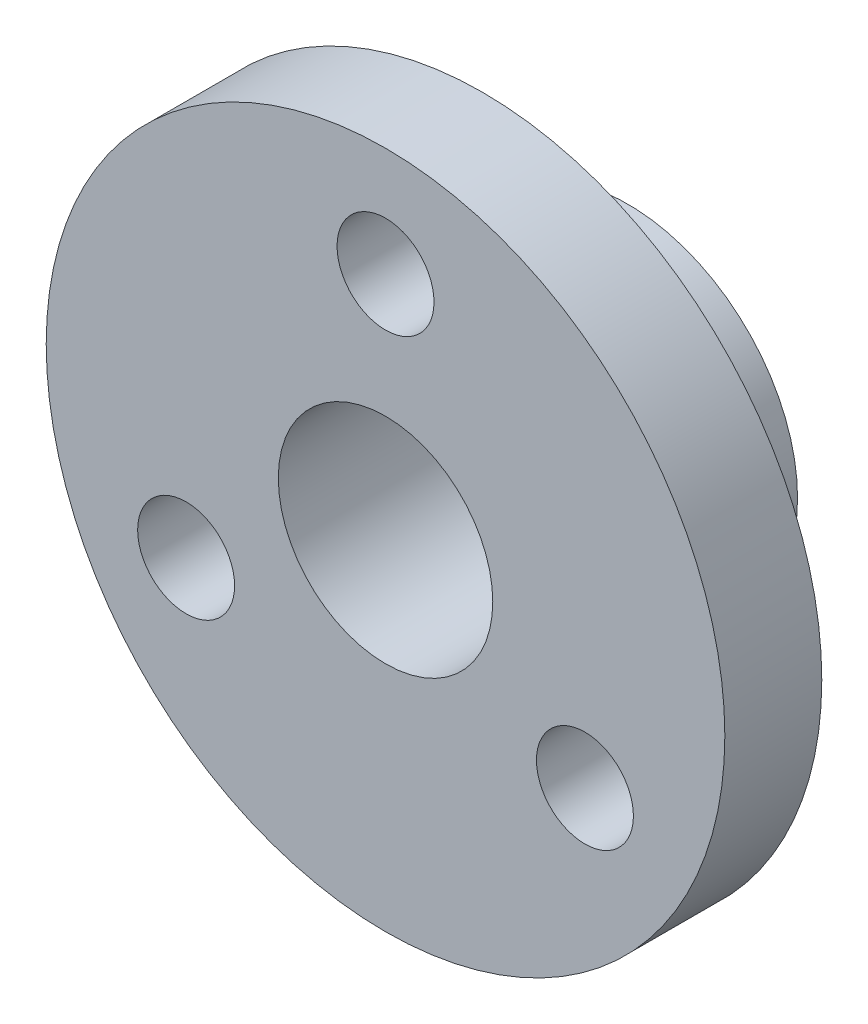
ISO-10303-21;
HEADER;
FILE_DESCRIPTION(('STEP AP214'),'2;1');
FILE_NAME('part.step','',(''),(''),'','','');
FILE_SCHEMA(('AUTOMOTIVE_DESIGN { 1 0 10303 214 1 1 1 1 }'));
ENDSEC;
DATA;
#1=APPLICATION_CONTEXT('core data for automotive mechanical design processes');
#2=APPLICATION_PROTOCOL_DEFINITION('international standard','automotive_design',2000,#1);
#3=PRODUCT_CONTEXT('',#1,'mechanical');
#4=PRODUCT('Part','Part','',(#3));
#5=PRODUCT_RELATED_PRODUCT_CATEGORY('part','',(#4));
#6=PRODUCT_DEFINITION_FORMATION('','',#4);
#7=PRODUCT_DEFINITION_CONTEXT('part definition',#1,'design');
#8=PRODUCT_DEFINITION('design','',#6,#7);
#9=PRODUCT_DEFINITION_SHAPE('','',#8);
#10=(LENGTH_UNIT() NAMED_UNIT(*) SI_UNIT(.MILLI.,.METRE.));
#11=(NAMED_UNIT(*) PLANE_ANGLE_UNIT() SI_UNIT($,.RADIAN.));
#12=(NAMED_UNIT(*) SI_UNIT($,.STERADIAN.) SOLID_ANGLE_UNIT());
#13=UNCERTAINTY_MEASURE_WITH_UNIT(LENGTH_MEASURE(1.E-05),#10,'distance_accuracy_value','');
#14=(GEOMETRIC_REPRESENTATION_CONTEXT(3) GLOBAL_UNCERTAINTY_ASSIGNED_CONTEXT((#13)) GLOBAL_UNIT_ASSIGNED_CONTEXT((#10,
#11,#12)) REPRESENTATION_CONTEXT('',''));
#15=CARTESIAN_POINT('',(0.,0.,0.));
#16=DIRECTION('',(0.,0.,1.));
#17=DIRECTION('',(1.,0.,0.));
#18=AXIS2_PLACEMENT_3D('',#15,#16,#17);
#19=CARTESIAN_POINT('',(-30.7119273786528,-38.9047607864826,1.4903225293725));
#20=DIRECTION('',(0.,0.,1.));
#21=DIRECTION('',(1.,0.,0.));
#22=AXIS2_PLACEMENT_3D('',#19,#20,#21);
#23=PLANE('',#22);
#24=CARTESIAN_POINT('',(-30.7119273786528,-35.7380941198159,1.4903225293725));
#25=DIRECTION('',(0.,0.,1.));
#26=DIRECTION('',(1.,0.,0.));
#27=AXIS2_PLACEMENT_3D('',#24,#25,#26);
#28=CIRCLE('',#27,0.666666666666665);
#29=CARTESIAN_POINT('',(-30.0452607119861,-35.7380941198159,1.4903225293725));
#30=VERTEX_POINT('',#29);
#31=EDGE_CURVE('E57',#30,#30,#28,.T.);
#32=ORIENTED_EDGE('',*,*,#31,.F.);
#33=EDGE_LOOP('',(#32));
#34=FACE_BOUND('',#33,.T.);
#35=CARTESIAN_POINT('',(-33.4543411573037,-40.4880941198159,1.4903225293725));
#36=DIRECTION('',(0.,0.,1.));
#37=DIRECTION('',(1.,0.,0.));
#38=AXIS2_PLACEMENT_3D('',#35,#36,#37);
#39=CIRCLE('',#38,0.666666666666666);
#40=CARTESIAN_POINT('',(-32.787674490637,-40.4880941198159,1.4903225293725));
#41=VERTEX_POINT('',#40);
#42=EDGE_CURVE('E60',#41,#41,#39,.T.);
#43=ORIENTED_EDGE('',*,*,#42,.F.);
#44=EDGE_LOOP('',(#43));
#45=FACE_BOUND('',#44,.T.);
#46=CARTESIAN_POINT('',(-27.9695136000022,-40.488094119816,1.4903225293725));
#47=DIRECTION('',(0.,0.,1.));
#48=DIRECTION('',(1.,0.,0.));
#49=AXIS2_PLACEMENT_3D('',#46,#47,#48);
#50=CIRCLE('',#49,0.666666666666664);
#51=CARTESIAN_POINT('',(-27.3028469333356,-40.488094119816,1.4903225293725));
#52=VERTEX_POINT('',#51);
#53=EDGE_CURVE('E63',#52,#52,#50,.T.);
#54=ORIENTED_EDGE('',*,*,#53,.F.);
#55=EDGE_LOOP('',(#54));
#56=FACE_BOUND('',#55,.T.);
#57=CARTESIAN_POINT('',(-30.7119273786528,-38.9047607864826,1.4903225293725));
#58=DIRECTION('',(0.,0.,1.));
#59=DIRECTION('',(1.,0.,0.));
#60=AXIS2_PLACEMENT_3D('',#57,#58,#59);
#61=CIRCLE('',#60,4.66666666666667);
#62=CARTESIAN_POINT('',(-26.0452607119861,-38.9047607864826,1.4903225293725));
#63=VERTEX_POINT('',#62);
#64=EDGE_CURVE('E10',#63,#63,#61,.T.);
#65=ORIENTED_EDGE('',*,*,#64,.T.);
#66=EDGE_LOOP('',(#65));
#67=FACE_BOUND('',#66,.T.);
#68=CARTESIAN_POINT('',(-30.7119273786528,-38.9047607864826,1.4903225293725));
#69=DIRECTION('',(0.,0.,1.));
#70=DIRECTION('',(1.,0.,0.));
#71=AXIS2_PLACEMENT_3D('',#68,#69,#70);
#72=CIRCLE('',#71,1.47490338192904);
#73=CARTESIAN_POINT('',(-29.2370239967238,-38.9047607864826,1.4903225293725));
#74=VERTEX_POINT('',#73);
#75=EDGE_CURVE('E47',#74,#74,#72,.T.);
#76=ORIENTED_EDGE('',*,*,#75,.F.);
#77=EDGE_LOOP('',(#76));
#78=FACE_BOUND('',#77,.T.);
#79=ADVANCED_FACE('F34',(#34,#45,#56,#67,#78),#23,.T.);
#80=CARTESIAN_POINT('',(-30.7119273786528,-38.9047607864826,0.156989196039167));
#81=DIRECTION('',(0.,0.,1.));
#82=DIRECTION('',(1.,0.,0.));
#83=AXIS2_PLACEMENT_3D('',#80,#81,#82);
#84=PLANE('',#83);
#85=CARTESIAN_POINT('',(-30.7119273786528,-35.7380941198159,0.156989196039167));
#86=DIRECTION('',(0.,0.,-1.));
#87=DIRECTION('',(-1.,0.,0.));
#88=AXIS2_PLACEMENT_3D('',#85,#86,#87);
#89=CIRCLE('',#88,0.666666666666665);
#90=CARTESIAN_POINT('',(-31.3785940453195,-35.7380941198159,0.156989196039167));
#91=VERTEX_POINT('',#90);
#92=EDGE_CURVE('E66',#91,#91,#89,.T.);
#93=ORIENTED_EDGE('',*,*,#92,.F.);
#94=EDGE_LOOP('',(#93));
#95=FACE_BOUND('',#94,.T.);
#96=CARTESIAN_POINT('',(-33.4543411573037,-40.4880941198159,0.156989196039167));
#97=DIRECTION('',(0.,0.,-1.));
#98=DIRECTION('',(-1.,0.,0.));
#99=AXIS2_PLACEMENT_3D('',#96,#97,#98);
#100=CIRCLE('',#99,0.666666666666666);
#101=CARTESIAN_POINT('',(-34.1210078239703,-40.4880941198159,0.156989196039167));
#102=VERTEX_POINT('',#101);
#103=EDGE_CURVE('E70',#102,#102,#100,.T.);
#104=ORIENTED_EDGE('',*,*,#103,.F.);
#105=EDGE_LOOP('',(#104));
#106=FACE_BOUND('',#105,.T.);
#107=CARTESIAN_POINT('',(-27.9695136000022,-40.488094119816,0.156989196039167));
#108=DIRECTION('',(0.,0.,-1.));
#109=DIRECTION('',(-1.,0.,0.));
#110=AXIS2_PLACEMENT_3D('',#107,#108,#109);
#111=CIRCLE('',#110,0.666666666666664);
#112=CARTESIAN_POINT('',(-28.6361802666689,-40.488094119816,0.156989196039167));
#113=VERTEX_POINT('',#112);
#114=EDGE_CURVE('E67',#113,#113,#111,.T.);
#115=ORIENTED_EDGE('',*,*,#114,.F.);
#116=EDGE_LOOP('',(#115));
#117=FACE_BOUND('',#116,.T.);
#118=CARTESIAN_POINT('',(-30.7119273786528,-38.9047607864826,0.156989196039167));
#119=DIRECTION('',(0.,0.,1.));
#120=DIRECTION('',(1.,0.,0.));
#121=AXIS2_PLACEMENT_3D('',#118,#119,#120);
#122=CIRCLE('',#121,2.33333333333333);
#123=CARTESIAN_POINT('',(-28.3785940453195,-38.9047607864826,0.156989196039167));
#124=VERTEX_POINT('',#123);
#125=EDGE_CURVE('E38',#124,#124,#122,.T.);
#126=ORIENTED_EDGE('',*,*,#125,.T.);
#127=EDGE_LOOP('',(#126));
#128=FACE_BOUND('',#127,.T.);
#129=CARTESIAN_POINT('',(-30.7119273786528,-38.9047607864826,0.156989196039167));
#130=DIRECTION('',(0.,0.,1.));
#131=DIRECTION('',(1.,0.,0.));
#132=AXIS2_PLACEMENT_3D('',#129,#130,#131);
#133=CIRCLE('',#132,4.66666666666667);
#134=CARTESIAN_POINT('',(-26.0452607119861,-38.9047607864826,0.156989196039167));
#135=VERTEX_POINT('',#134);
#136=EDGE_CURVE('E42',#135,#135,#133,.T.);
#137=ORIENTED_EDGE('',*,*,#136,.F.);
#138=EDGE_LOOP('',(#137));
#139=FACE_BOUND('',#138,.T.);
#140=ADVANCED_FACE('F78',(#95,#106,#117,#128,#139),#84,.F.);
#141=CARTESIAN_POINT('',(-30.7119273786528,-38.9047607864826,1.4903225293725));
#142=DIRECTION('',(0.,0.,-1.));
#143=DIRECTION('',(-1.,0.,0.));
#144=AXIS2_PLACEMENT_3D('',#141,#142,#143);
#145=CYLINDRICAL_SURFACE('',#144,4.66666666666667);
#146=ORIENTED_EDGE('',*,*,#64,.F.);
#147=EDGE_LOOP('',(#146));
#148=FACE_BOUND('',#147,.T.);
#149=ORIENTED_EDGE('',*,*,#136,.T.);
#150=EDGE_LOOP('',(#149));
#151=FACE_BOUND('',#150,.T.);
#152=ADVANCED_FACE('F36',(#148,#151),#145,.T.);
#153=CARTESIAN_POINT('',(-30.7119273786528,-38.9047607864826,1.4903225293725));
#154=DIRECTION('',(0.,0.,-1.));
#155=DIRECTION('',(-1.,0.,0.));
#156=AXIS2_PLACEMENT_3D('',#153,#154,#155);
#157=CYLINDRICAL_SURFACE('',#156,1.47490338192904);
#158=ORIENTED_EDGE('',*,*,#75,.T.);
#159=EDGE_LOOP('',(#158));
#160=FACE_BOUND('',#159,.T.);
#161=CARTESIAN_POINT('',(-30.7119273786528,-38.9047607864826,-1.84301080396083));
#162=DIRECTION('',(0.,0.,1.));
#163=DIRECTION('',(1.,0.,0.));
#164=AXIS2_PLACEMENT_3D('',#161,#162,#163);
#165=CIRCLE('',#164,1.47490338192904);
#166=CARTESIAN_POINT('',(-29.2370239967238,-38.9047607864826,-1.84301080396083));
#167=VERTEX_POINT('',#166);
#168=EDGE_CURVE('E54',#167,#167,#165,.T.);
#169=ORIENTED_EDGE('',*,*,#168,.F.);
#170=EDGE_LOOP('',(#169));
#171=FACE_BOUND('',#170,.T.);
#172=ADVANCED_FACE('F91',(#160,#171),#157,.F.);
#173=CARTESIAN_POINT('',(-30.7119273786528,-38.9047607864826,-1.84301080396083));
#174=DIRECTION('',(0.,0.,1.));
#175=DIRECTION('',(1.,0.,0.));
#176=AXIS2_PLACEMENT_3D('',#173,#174,#175);
#177=CYLINDRICAL_SURFACE('',#176,2.33333333333333);
#178=CARTESIAN_POINT('',(-30.7119273786528,-38.9047607864826,-1.84301080396083));
#179=DIRECTION('',(0.,0.,1.));
#180=DIRECTION('',(1.,0.,0.));
#181=AXIS2_PLACEMENT_3D('',#178,#179,#180);
#182=CIRCLE('',#181,2.33333333333333);
#183=CARTESIAN_POINT('',(-28.3785940453195,-38.9047607864826,-1.84301080396083));
#184=VERTEX_POINT('',#183);
#185=EDGE_CURVE('E51',#184,#184,#182,.T.);
#186=ORIENTED_EDGE('',*,*,#185,.T.);
#187=EDGE_LOOP('',(#186));
#188=FACE_BOUND('',#187,.T.);
#189=ORIENTED_EDGE('',*,*,#125,.F.);
#190=EDGE_LOOP('',(#189));
#191=FACE_BOUND('',#190,.T.);
#192=ADVANCED_FACE('F96',(#188,#191),#177,.T.);
#193=CARTESIAN_POINT('',(-30.7119273786528,-38.9047607864826,-1.84301080396083));
#194=DIRECTION('',(0.,0.,1.));
#195=DIRECTION('',(1.,0.,0.));
#196=AXIS2_PLACEMENT_3D('',#193,#194,#195);
#197=PLANE('',#196);
#198=ORIENTED_EDGE('',*,*,#168,.T.);
#199=EDGE_LOOP('',(#198));
#200=FACE_BOUND('',#199,.T.);
#201=ORIENTED_EDGE('',*,*,#185,.F.);
#202=EDGE_LOOP('',(#201));
#203=FACE_BOUND('',#202,.T.);
#204=ADVANCED_FACE('F109',(#200,#203),#197,.F.);
#205=CARTESIAN_POINT('',(-27.9695136000022,-40.488094119816,3.4903225293725));
#206=DIRECTION('',(0.,0.,-1.));
#207=DIRECTION('',(-1.,0.,0.));
#208=AXIS2_PLACEMENT_3D('',#205,#206,#207);
#209=CYLINDRICAL_SURFACE('',#208,0.666666666666664);
#210=ORIENTED_EDGE('',*,*,#53,.T.);
#211=EDGE_LOOP('',(#210));
#212=FACE_BOUND('',#211,.T.);
#213=ORIENTED_EDGE('',*,*,#114,.T.);
#214=EDGE_LOOP('',(#213));
#215=FACE_BOUND('',#214,.T.);
#216=ADVANCED_FACE('F113',(#212,#215),#209,.F.);
#217=CARTESIAN_POINT('',(-33.4543411573037,-40.4880941198159,3.4903225293725));
#218=DIRECTION('',(0.,0.,-1.));
#219=DIRECTION('',(-1.,0.,0.));
#220=AXIS2_PLACEMENT_3D('',#217,#218,#219);
#221=CYLINDRICAL_SURFACE('',#220,0.666666666666666);
#222=ORIENTED_EDGE('',*,*,#42,.T.);
#223=EDGE_LOOP('',(#222));
#224=FACE_BOUND('',#223,.T.);
#225=ORIENTED_EDGE('',*,*,#103,.T.);
#226=EDGE_LOOP('',(#225));
#227=FACE_BOUND('',#226,.T.);
#228=ADVANCED_FACE('F117',(#224,#227),#221,.F.);
#229=CARTESIAN_POINT('',(-30.7119273786528,-35.7380941198159,3.4903225293725));
#230=DIRECTION('',(0.,0.,-1.));
#231=DIRECTION('',(-1.,0.,0.));
#232=AXIS2_PLACEMENT_3D('',#229,#230,#231);
#233=CYLINDRICAL_SURFACE('',#232,0.666666666666665);
#234=ORIENTED_EDGE('',*,*,#31,.T.);
#235=EDGE_LOOP('',(#234));
#236=FACE_BOUND('',#235,.T.);
#237=ORIENTED_EDGE('',*,*,#92,.T.);
#238=EDGE_LOOP('',(#237));
#239=FACE_BOUND('',#238,.T.);
#240=ADVANCED_FACE('F76',(#236,#239),#233,.F.);
#241=CLOSED_SHELL('',(#79,#140,#152,#172,#192,#204,#216,#228,#240));
#242=MANIFOLD_SOLID_BREP('B2',#241);
#243=ADVANCED_BREP_SHAPE_REPRESENTATION('',(#18,#242),#14);
#244=SHAPE_DEFINITION_REPRESENTATION(#9,#243);
ENDSEC;
END-ISO-10303-21;
